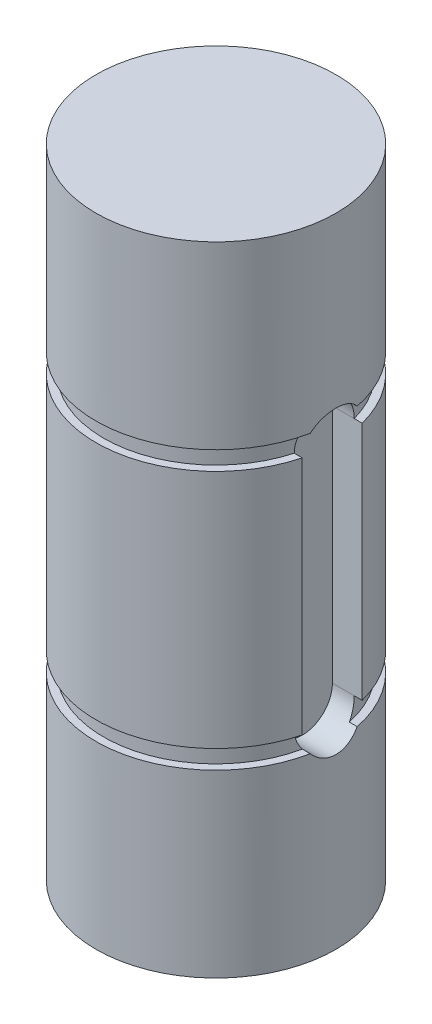
ISO-10303-21;
HEADER;
FILE_DESCRIPTION(('STEP AP214'),'2;1');
FILE_NAME('part.step','',(''),(''),'','','');
FILE_SCHEMA(('AUTOMOTIVE_DESIGN { 1 0 10303 214 1 1 1 1 }'));
ENDSEC;
DATA;
#1=APPLICATION_CONTEXT('core data for automotive mechanical design processes');
#2=APPLICATION_PROTOCOL_DEFINITION('international standard','automotive_design',2000,#1);
#3=PRODUCT_CONTEXT('',#1,'mechanical');
#4=PRODUCT('Part','Part','',(#3));
#5=PRODUCT_RELATED_PRODUCT_CATEGORY('part','',(#4));
#6=PRODUCT_DEFINITION_FORMATION('','',#4);
#7=PRODUCT_DEFINITION_CONTEXT('part definition',#1,'design');
#8=PRODUCT_DEFINITION('design','',#6,#7);
#9=PRODUCT_DEFINITION_SHAPE('','',#8);
#10=(LENGTH_UNIT() NAMED_UNIT(*) SI_UNIT(.MILLI.,.METRE.));
#11=(NAMED_UNIT(*) PLANE_ANGLE_UNIT() SI_UNIT($,.RADIAN.));
#12=(NAMED_UNIT(*) SI_UNIT($,.STERADIAN.) SOLID_ANGLE_UNIT());
#13=UNCERTAINTY_MEASURE_WITH_UNIT(LENGTH_MEASURE(1.E-05),#10,'distance_accuracy_value','');
#14=(GEOMETRIC_REPRESENTATION_CONTEXT(3) GLOBAL_UNCERTAINTY_ASSIGNED_CONTEXT((#13)) GLOBAL_UNIT_ASSIGNED_CONTEXT((#10,
#11,#12)) REPRESENTATION_CONTEXT('',''));
#15=CARTESIAN_POINT('',(0.,0.,0.));
#16=DIRECTION('',(0.,0.,1.));
#17=DIRECTION('',(1.,0.,0.));
#18=AXIS2_PLACEMENT_3D('',#15,#16,#17);
#19=CARTESIAN_POINT('',(0.,33.7312,0.));
#20=DIRECTION('',(0.,-1.,0.));
#21=DIRECTION('',(0.,0.,-1.));
#22=AXIS2_PLACEMENT_3D('',#19,#20,#21);
#23=CYLINDRICAL_SURFACE('',#22,6.35);
#24=DIRECTION('',(0.,-1.,0.));
#25=VECTOR('',#24,1.);
#26=CARTESIAN_POINT('',(6.14836106210428,33.7312,-1.5875));
#27=LINE('',#26,#25);
#28=CARTESIAN_POINT('',(6.14836106210427,10.5156,-1.5875));
#29=VERTEX_POINT('',#28);
#30=CARTESIAN_POINT('',(6.14836106210428,23.2156,-1.5875));
#31=VERTEX_POINT('',#30);
#32=EDGE_CURVE('E272',#29,#31,#27,.F.);
#33=ORIENTED_EDGE('',*,*,#32,.F.);
#34=CARTESIAN_POINT('',(0.,10.5156,0.));
#35=DIRECTION('',(0.,1.,0.));
#36=DIRECTION('',(0.,0.,1.));
#37=AXIS2_PLACEMENT_3D('',#34,#35,#36);
#38=CIRCLE('',#37,6.35);
#39=CARTESIAN_POINT('',(6.14836106210428,10.5156,1.5875));
#40=VERTEX_POINT('',#39);
#41=EDGE_CURVE('E189',#29,#40,#38,.T.);
#42=ORIENTED_EDGE('',*,*,#41,.T.);
#43=DIRECTION('',(0.,-1.,0.));
#44=VECTOR('',#43,1.);
#45=CARTESIAN_POINT('',(6.14836106210427,33.7312,1.5875));
#46=LINE('',#45,#44);
#47=CARTESIAN_POINT('',(6.14836106210428,23.2156,1.5875));
#48=VERTEX_POINT('',#47);
#49=EDGE_CURVE('E275',#40,#48,#46,.F.);
#50=ORIENTED_EDGE('',*,*,#49,.T.);
#51=CARTESIAN_POINT('',(0.,23.2156,0.));
#52=DIRECTION('',(0.,-1.,0.));
#53=DIRECTION('',(0.,0.,-1.));
#54=AXIS2_PLACEMENT_3D('',#51,#52,#53);
#55=CIRCLE('',#54,6.35);
#56=EDGE_CURVE('E193',#48,#31,#55,.T.);
#57=ORIENTED_EDGE('',*,*,#56,.T.);
#58=EDGE_LOOP('',(#33,#42,#50,#57));
#59=FACE_BOUND('',#58,.T.);
#60=ADVANCED_FACE('F32',(#59),#23,.T.);
#61=CARTESIAN_POINT('',(0.,23.2156,26.6920467660534));
#62=DIRECTION('',(0.,-1.,0.));
#63=DIRECTION('',(0.,0.,-1.));
#64=AXIS2_PLACEMENT_3D('',#61,#62,#63);
#65=PLANE('',#64);
#66=DIRECTION('',(1.,0.,0.));
#67=VECTOR('',#66,1.);
#68=CARTESIAN_POINT('',(4.572,23.2156,-1.5875));
#69=LINE('',#68,#67);
#70=CARTESIAN_POINT('',(5.72767184028554,23.2156,-1.5875));
#71=VERTEX_POINT('',#70);
#72=EDGE_CURVE('E144',#71,#31,#69,.T.);
#73=ORIENTED_EDGE('',*,*,#72,.T.);
#74=ORIENTED_EDGE('',*,*,#56,.F.);
#75=DIRECTION('',(1.,0.,0.));
#76=VECTOR('',#75,1.);
#77=CARTESIAN_POINT('',(4.572,23.2156,1.5875));
#78=LINE('',#77,#76);
#79=CARTESIAN_POINT('',(5.72767184028554,23.2156,1.5875));
#80=VERTEX_POINT('',#79);
#81=EDGE_CURVE('E123',#80,#48,#78,.T.);
#82=ORIENTED_EDGE('',*,*,#81,.F.);
#83=CARTESIAN_POINT('',(0.,23.2156,0.));
#84=DIRECTION('',(0.,1.,0.));
#85=DIRECTION('',(0.,0.,1.));
#86=AXIS2_PLACEMENT_3D('',#83,#84,#85);
#87=CIRCLE('',#86,5.9436);
#88=EDGE_CURVE('E200',#71,#80,#87,.T.);
#89=ORIENTED_EDGE('',*,*,#88,.F.);
#90=EDGE_LOOP('',(#73,#74,#82,#89));
#91=FACE_BOUND('',#90,.T.);
#92=ADVANCED_FACE('F246',(#91),#65,.F.);
#93=CARTESIAN_POINT('',(0.,24.2062,26.6920467660534));
#94=DIRECTION('',(0.,1.,0.));
#95=DIRECTION('',(0.,0.,1.));
#96=AXIS2_PLACEMENT_3D('',#93,#94,#95);
#97=PLANE('',#96);
#98=CARTESIAN_POINT('',(0.,24.2062,0.));
#99=DIRECTION('',(0.,1.,0.));
#100=DIRECTION('',(0.,0.,1.));
#101=AXIS2_PLACEMENT_3D('',#98,#99,#100);
#102=CIRCLE('',#101,5.9436);
#103=CARTESIAN_POINT('',(5.81270273366874,24.2062,-1.24051114061906));
#104=VERTEX_POINT('',#103);
#105=CARTESIAN_POINT('',(5.81270273366874,24.2062,1.24051114061906));
#106=VERTEX_POINT('',#105);
#107=EDGE_CURVE('E188',#104,#106,#102,.T.);
#108=ORIENTED_EDGE('',*,*,#107,.T.);
#109=DIRECTION('',(1.,0.,0.));
#110=VECTOR('',#109,1.);
#111=CARTESIAN_POINT('',(4.572,24.2062,1.24051114061906));
#112=LINE('',#111,#110);
#113=CARTESIAN_POINT('',(6.22765060917839,24.2062,1.24051114061906));
#114=VERTEX_POINT('',#113);
#115=EDGE_CURVE('E60',#106,#114,#112,.T.);
#116=ORIENTED_EDGE('',*,*,#115,.T.);
#117=CARTESIAN_POINT('',(0.,24.2062,0.));
#118=DIRECTION('',(0.,1.,0.));
#119=DIRECTION('',(0.,0.,1.));
#120=AXIS2_PLACEMENT_3D('',#117,#118,#119);
#121=CIRCLE('',#120,6.35);
#122=CARTESIAN_POINT('',(6.22765060917839,24.2062,-1.24051114061906));
#123=VERTEX_POINT('',#122);
#124=EDGE_CURVE('E197',#123,#114,#121,.T.);
#125=ORIENTED_EDGE('',*,*,#124,.F.);
#126=DIRECTION('',(1.,0.,0.));
#127=VECTOR('',#126,1.);
#128=CARTESIAN_POINT('',(4.572,24.2062,-1.24051114061906));
#129=LINE('',#128,#127);
#130=EDGE_CURVE('E269',#123,#104,#129,.F.);
#131=ORIENTED_EDGE('',*,*,#130,.T.);
#132=EDGE_LOOP('',(#108,#116,#125,#131));
#133=FACE_BOUND('',#132,.T.);
#134=ADVANCED_FACE('F251',(#133),#97,.F.);
#135=CARTESIAN_POINT('',(0.,25.5170502343723,0.));
#136=DIRECTION('',(0.,1.,0.));
#137=DIRECTION('',(0.,0.,1.));
#138=AXIS2_PLACEMENT_3D('',#135,#136,#137);
#139=CYLINDRICAL_SURFACE('',#138,5.9436);
#140=ORIENTED_EDGE('',*,*,#88,.T.);
#141=CARTESIAN_POINT('',(5.72767184028554,23.2156,1.5875));
#142=CARTESIAN_POINT('',(5.72766804610027,23.2599788866215,1.58750194805808));
#143=CARTESIAN_POINT('',(5.72818813422053,23.3043382686311,1.58563830137082));
#144=CARTESIAN_POINT('',(5.73024000478096,23.392712391909,1.57821195212509));
#145=CARTESIAN_POINT('',(5.73177154850906,23.4367272120173,1.57265012236694));
#146=CARTESIAN_POINT('',(5.73771384551916,23.5653217209515,1.55088835422927));
#147=CARTESIAN_POINT('',(5.74347777277273,23.6490289517323,1.52960258418085));
#148=CARTESIAN_POINT('',(5.75836292111803,23.8153481785975,1.47259415694831));
#149=CARTESIAN_POINT('',(5.76762462415825,23.8977380974612,1.43626019797556));
#150=CARTESIAN_POINT('',(5.78329806159334,24.0168087718749,1.37126100174845));
#151=CARTESIAN_POINT('',(5.78891663315768,24.0562960658287,1.34740876355262));
#152=CARTESIAN_POINT('',(5.80055334186276,24.1330038913665,1.29639711833931));
#153=CARTESIAN_POINT('',(5.80657142646175,24.1702247197941,1.26923814581491));
#154=CARTESIAN_POINT('',(5.81270273366874,24.2062,1.24051114061906));
#155=B_SPLINE_CURVE_WITH_KNOTS('',3,(#141,#142,#143,#144,#145,#146,#147,#148,#149,#150,#151,
#152,#153,#154),.UNSPECIFIED.,.F.,.F.,(4,2,2,2,2,2,4),(0.,0.13305635000979,0.26608130881389,
0.524501760701662,0.794649138064699,0.933915485774885,1.07316355409293),.UNSPECIFIED.);
#156=EDGE_CURVE('E119',#80,#106,#155,.T.);
#157=ORIENTED_EDGE('',*,*,#156,.T.);
#158=ORIENTED_EDGE('',*,*,#107,.F.);
#159=CARTESIAN_POINT('',(5.81270273366874,24.2062,-1.24051114061906));
#160=CARTESIAN_POINT('',(5.80676093223229,24.17133733761,-1.26835031027519));
#161=CARTESIAN_POINT('',(5.8009253407225,24.1353032972455,-1.29471734166642));
#162=CARTESIAN_POINT('',(5.78962448943312,24.061101088542,-1.34435038702208));
#163=CARTESIAN_POINT('',(5.78415925642407,24.0229327662943,-1.36761617693749));
#164=CARTESIAN_POINT('',(5.76886044428707,23.9078281402528,-1.43125963250244));
#165=CARTESIAN_POINT('',(5.75975979338477,23.828231861975,-1.46711930717738));
#166=CARTESIAN_POINT('',(5.74448324543572,23.6625483974185,-1.52585859113951));
#167=CARTESIAN_POINT('',(5.73835992335597,23.576373607262,-1.54850619216327));
#168=CARTESIAN_POINT('',(5.73203917642506,23.4438296974734,-1.57167662157916));
#169=CARTESIAN_POINT('',(5.73040804690452,23.3984147554939,-1.57760264372825));
#170=CARTESIAN_POINT('',(5.72822216727329,23.3072074368185,-1.58551566901053));
#171=CARTESIAN_POINT('',(5.72766765395878,23.2614149793135,-1.58750180558824));
#172=CARTESIAN_POINT('',(5.72767184028554,23.2156,-1.5875));
#173=B_SPLINE_CURVE_WITH_KNOTS('',3,(#159,#160,#161,#162,#163,#164,#165,#166,#167,#168,#169,
#170,#171,#172),.UNSPECIFIED.,.F.,.F.,(4,2,2,2,2,2,4),(0.,0.13494965007682,0.26990904430556,
0.531960547427977,0.798485077464082,0.935809383428476,1.07316388974743),.UNSPECIFIED.);
#174=EDGE_CURVE('E219',#104,#71,#173,.T.);
#175=ORIENTED_EDGE('',*,*,#174,.T.);
#176=EDGE_LOOP('',(#140,#157,#158,#175));
#177=FACE_BOUND('',#176,.T.);
#178=ADVANCED_FACE('F224',(#177),#139,.T.);
#179=CARTESIAN_POINT('',(0.,33.7312,0.));
#180=DIRECTION('',(0.,1.,0.));
#181=DIRECTION('',(0.,0.,1.));
#182=AXIS2_PLACEMENT_3D('',#179,#180,#181);
#183=PLANE('',#182);
#184=CARTESIAN_POINT('',(0.,33.7312,0.));
#185=DIRECTION('',(0.,1.,0.));
#186=DIRECTION('',(0.,0.,1.));
#187=AXIS2_PLACEMENT_3D('',#184,#185,#186);
#188=CIRCLE('',#187,6.35);
#189=CARTESIAN_POINT('',(0.,33.7312,6.35));
#190=VERTEX_POINT('',#189);
#191=EDGE_CURVE('E184',#190,#190,#188,.T.);
#192=ORIENTED_EDGE('',*,*,#191,.T.);
#193=EDGE_LOOP('',(#192));
#194=FACE_BOUND('',#193,.T.);
#195=ADVANCED_FACE('F257',(#194),#183,.T.);
#196=ORIENTED_EDGE('',*,*,#124,.T.);
#197=CARTESIAN_POINT('',(6.22765060917839,24.2062,1.24051114061906));
#198=CARTESIAN_POINT('',(6.23320783945382,24.2411378215592,1.2126102393573));
#199=CARTESIAN_POINT('',(6.23886039060933,24.2748712636352,1.18325559981259));
#200=CARTESIAN_POINT('',(6.25020149422038,24.339741606585,1.12181126216661));
#201=CARTESIAN_POINT('',(6.25589004691655,24.3708784900839,1.08972154576645));
#202=CARTESIAN_POINT('',(6.2727722846694,24.4600837099081,0.989640681923255));
#203=CARTESIAN_POINT('',(6.28378811857192,24.5139801382244,0.917811004237599));
#204=CARTESIAN_POINT('',(6.3041083179383,24.6090151207872,0.765894226562205));
#205=CARTESIAN_POINT('',(6.31341126157691,24.6501430955301,0.685800351954505));
#206=CARTESIAN_POINT('',(6.32925406928647,24.7183365380244,0.519609689028019));
#207=CARTESIAN_POINT('',(6.33579564411445,24.7454107149523,0.433516656017828));
#208=CARTESIAN_POINT('',(6.34529454604823,24.7842846308184,0.259270320083057));
#209=CARTESIAN_POINT('',(6.34830987825246,24.7963317849185,0.171175393891058));
#210=CARTESIAN_POINT('',(6.35061397512241,24.8055608892268,-0.00584854805475006));
#211=CARTESIAN_POINT('',(6.34990259861924,24.802742276315,-0.0947775952779503));
#212=CARTESIAN_POINT('',(6.34488868818956,24.7825583908652,-0.268922050286369));
#213=CARTESIAN_POINT('',(6.34066327595629,24.765505485485,-0.354176205390181));
#214=CARTESIAN_POINT('',(6.32917385599744,24.7178081997939,-0.520596366331586));
#215=CARTESIAN_POINT('',(6.32190904766935,24.6871602383026,-0.601761288714865));
#216=CARTESIAN_POINT('',(6.30501409455028,24.6128048506769,-0.758684558613027));
#217=CARTESIAN_POINT('',(6.29535881787929,24.5689575225197,-0.834373638215747));
#218=CARTESIAN_POINT('',(6.27474734999085,24.4695771479035,-0.977374398357579));
#219=CARTESIAN_POINT('',(6.26379263841329,24.41405733804,-1.04469543181985));
#220=CARTESIAN_POINT('',(6.24855866645397,24.3303466372952,-1.13075323727132));
#221=CARTESIAN_POINT('',(6.24433654135724,24.3064629829803,-1.15381013700283));
#222=CARTESIAN_POINT('',(6.23594250238016,24.2573387160929,-1.19834525875782));
#223=CARTESIAN_POINT('',(6.2317705110774,24.2321006532646,-1.21982627860311));
#224=CARTESIAN_POINT('',(6.22765060917839,24.2062,-1.24051114061906));
#225=B_SPLINE_CURVE_WITH_KNOTS('',3,(#197,#198,#199,#200,#201,#202,#203,#204,#205,#206,#207,
#208,#209,#210,#211,#212,#213,#214,#215,#216,#217,#218,#219,#220,#221,#222,#223,#224),
.UNSPECIFIED.,.F.,.F.,(4,2,2,2,2,2,2,2,2,2,2,2,2,4),(0.,0.135083283921325,0.270167471681556,
0.540207610771848,0.810470902383522,1.08056651055368,1.34615372554165,1.6117510011295,
1.87166851811822,2.13165454271636,2.39449949657434,2.65704797661509,2.75739135215893,
2.8575520354902),.UNSPECIFIED.);
#226=EDGE_CURVE('E11',#114,#123,#225,.T.);
#227=ORIENTED_EDGE('',*,*,#226,.T.);
#228=EDGE_LOOP('',(#196,#227));
#229=FACE_BOUND('',#228,.T.);
#230=ORIENTED_EDGE('',*,*,#191,.F.);
#231=EDGE_LOOP('',(#230));
#232=FACE_BOUND('',#231,.T.);
#233=ADVANCED_FACE('F34',(#229,#232),#23,.T.);
#234=CARTESIAN_POINT('',(0.,9.525,21.2804229426845));
#235=DIRECTION('',(0.,-1.,0.));
#236=DIRECTION('',(0.,0.,-1.));
#237=AXIS2_PLACEMENT_3D('',#234,#235,#236);
#238=PLANE('',#237);
#239=CARTESIAN_POINT('',(0.,9.525,0.));
#240=DIRECTION('',(0.,1.,0.));
#241=DIRECTION('',(0.,0.,1.));
#242=AXIS2_PLACEMENT_3D('',#239,#240,#241);
#243=CIRCLE('',#242,5.9436);
#244=CARTESIAN_POINT('',(5.81270273366873,9.525,-1.24051114061906));
#245=VERTEX_POINT('',#244);
#246=CARTESIAN_POINT('',(5.81270273366873,9.525,1.24051114061906));
#247=VERTEX_POINT('',#246);
#248=EDGE_CURVE('E192',#245,#247,#243,.T.);
#249=ORIENTED_EDGE('',*,*,#248,.F.);
#250=DIRECTION('',(1.,0.,0.));
#251=VECTOR('',#250,1.);
#252=CARTESIAN_POINT('',(4.572,9.525,-1.24051114061906));
#253=LINE('',#252,#251);
#254=CARTESIAN_POINT('',(6.22765060917839,9.52500000000001,-1.24051114061906));
#255=VERTEX_POINT('',#254);
#256=EDGE_CURVE('E151',#245,#255,#253,.T.);
#257=ORIENTED_EDGE('',*,*,#256,.T.);
#258=CARTESIAN_POINT('',(0.,9.52500000000001,0.));
#259=DIRECTION('',(0.,-1.,0.));
#260=DIRECTION('',(0.,0.,-1.));
#261=AXIS2_PLACEMENT_3D('',#258,#259,#260);
#262=CIRCLE('',#261,6.35);
#263=CARTESIAN_POINT('',(6.22765060917839,9.52500000000001,1.24051114061906));
#264=VERTEX_POINT('',#263);
#265=EDGE_CURVE('E185',#264,#255,#262,.T.);
#266=ORIENTED_EDGE('',*,*,#265,.F.);
#267=DIRECTION('',(1.,0.,0.));
#268=VECTOR('',#267,1.);
#269=CARTESIAN_POINT('',(4.572,9.525,1.24051114061906));
#270=LINE('',#269,#268);
#271=EDGE_CURVE('E52',#264,#247,#270,.F.);
#272=ORIENTED_EDGE('',*,*,#271,.T.);
#273=EDGE_LOOP('',(#249,#257,#266,#272));
#274=FACE_BOUND('',#273,.T.);
#275=ADVANCED_FACE('F235',(#274),#238,.F.);
#276=CARTESIAN_POINT('',(0.,10.5156,21.2804229426845));
#277=DIRECTION('',(0.,1.,0.));
#278=DIRECTION('',(0.,0.,1.));
#279=AXIS2_PLACEMENT_3D('',#276,#277,#278);
#280=PLANE('',#279);
#281=ORIENTED_EDGE('',*,*,#41,.F.);
#282=DIRECTION('',(1.,0.,0.));
#283=VECTOR('',#282,1.);
#284=CARTESIAN_POINT('',(4.572,10.5156,-1.5875));
#285=LINE('',#284,#283);
#286=CARTESIAN_POINT('',(5.72767184028554,10.5156,-1.5875));
#287=VERTEX_POINT('',#286);
#288=EDGE_CURVE('E148',#287,#29,#285,.T.);
#289=ORIENTED_EDGE('',*,*,#288,.F.);
#290=CARTESIAN_POINT('',(0.,10.5156,0.));
#291=DIRECTION('',(0.,1.,0.));
#292=DIRECTION('',(0.,0.,1.));
#293=AXIS2_PLACEMENT_3D('',#290,#291,#292);
#294=CIRCLE('',#293,5.9436);
#295=CARTESIAN_POINT('',(5.72767184028554,10.5156,1.5875));
#296=VERTEX_POINT('',#295);
#297=EDGE_CURVE('E211',#287,#296,#294,.T.);
#298=ORIENTED_EDGE('',*,*,#297,.T.);
#299=DIRECTION('',(1.,0.,0.));
#300=VECTOR('',#299,1.);
#301=CARTESIAN_POINT('',(4.572,10.5156,1.5875));
#302=LINE('',#301,#300);
#303=EDGE_CURVE('E122',#296,#40,#302,.T.);
#304=ORIENTED_EDGE('',*,*,#303,.T.);
#305=EDGE_LOOP('',(#281,#289,#298,#304));
#306=FACE_BOUND('',#305,.T.);
#307=ADVANCED_FACE('F231',(#306),#280,.F.);
#308=CARTESIAN_POINT('',(0.,15.810643297175,0.));
#309=DIRECTION('',(0.,1.,0.));
#310=DIRECTION('',(0.,0.,1.));
#311=AXIS2_PLACEMENT_3D('',#308,#309,#310);
#312=CYLINDRICAL_SURFACE('',#311,5.9436);
#313=ORIENTED_EDGE('',*,*,#248,.T.);
#314=CARTESIAN_POINT('',(5.81270273366874,9.525,1.24051114061906));
#315=CARTESIAN_POINT('',(5.80676093223229,9.55986266239004,1.26835031027519));
#316=CARTESIAN_POINT('',(5.8009253407225,9.59589670275452,1.29471734166642));
#317=CARTESIAN_POINT('',(5.78962448943312,9.67009891145804,1.34435038702208));
#318=CARTESIAN_POINT('',(5.78415925642407,9.7082672337057,1.3676161769375));
#319=CARTESIAN_POINT('',(5.76886044428707,9.82337185974724,1.43125963250244));
#320=CARTESIAN_POINT('',(5.75975979338477,9.90296813802501,1.46711930717738));
#321=CARTESIAN_POINT('',(5.74448324543573,10.0686516025815,1.52585859113951));
#322=CARTESIAN_POINT('',(5.73835992335597,10.154826392738,1.54850619216327));
#323=CARTESIAN_POINT('',(5.73203917642506,10.2873703025266,1.57167662157916));
#324=CARTESIAN_POINT('',(5.73040804690452,10.3327852445061,1.57760264372825));
#325=CARTESIAN_POINT('',(5.72822216727329,10.4239925631815,1.58551566901053));
#326=CARTESIAN_POINT('',(5.72766765395878,10.4697850206865,1.58750180558824));
#327=CARTESIAN_POINT('',(5.72767184028554,10.5156,1.5875));
#328=B_SPLINE_CURVE_WITH_KNOTS('',3,(#314,#315,#316,#317,#318,#319,#320,#321,#322,#323,#324,
#325,#326,#327),.UNSPECIFIED.,.F.,.F.,(4,2,2,2,2,2,4),(0.,0.134949650076818,0.269909044305558,
0.531960547427973,0.798485077464077,0.935809383428472,1.07316388974743),.UNSPECIFIED.);
#329=EDGE_CURVE('E162',#247,#296,#328,.T.);
#330=ORIENTED_EDGE('',*,*,#329,.T.);
#331=ORIENTED_EDGE('',*,*,#297,.F.);
#332=CARTESIAN_POINT('',(5.72767184028554,10.5156,-1.5875));
#333=CARTESIAN_POINT('',(5.72766804610027,10.4712211133786,-1.58750194805808));
#334=CARTESIAN_POINT('',(5.72818813422053,10.4268617313689,-1.58563830137082));
#335=CARTESIAN_POINT('',(5.73024000478097,10.338487608091,-1.57821195212509));
#336=CARTESIAN_POINT('',(5.73177154850907,10.2944727879828,-1.57265012236694));
#337=CARTESIAN_POINT('',(5.73771384551916,10.1658782790485,-1.55088835422927));
#338=CARTESIAN_POINT('',(5.74347777277273,10.0821710482677,-1.52960258418085));
#339=CARTESIAN_POINT('',(5.75836292111803,9.91585182140255,-1.47259415694831));
#340=CARTESIAN_POINT('',(5.76762462415825,9.83346190253884,-1.43626019797556));
#341=CARTESIAN_POINT('',(5.78329806159334,9.71439122812507,-1.37126100174845));
#342=CARTESIAN_POINT('',(5.78891663315768,9.67490393417133,-1.34740876355262));
#343=CARTESIAN_POINT('',(5.80055334186276,9.59819610863347,-1.29639711833932));
#344=CARTESIAN_POINT('',(5.80657142646175,9.56097528020593,-1.26923814581492));
#345=CARTESIAN_POINT('',(5.81270273366874,9.52500000000001,-1.24051114061906));
#346=B_SPLINE_CURVE_WITH_KNOTS('',3,(#332,#333,#334,#335,#336,#337,#338,#339,#340,#341,#342,
#343,#344,#345),.UNSPECIFIED.,.F.,.F.,(4,2,2,2,2,2,4),(0.,0.133056350009787,0.266081308813888,
0.524501760701664,0.794649138064696,0.933915485774881,1.07316355409293),.UNSPECIFIED.);
#347=EDGE_CURVE('E154',#287,#245,#346,.T.);
#348=ORIENTED_EDGE('',*,*,#347,.T.);
#349=EDGE_LOOP('',(#313,#330,#331,#348));
#350=FACE_BOUND('',#349,.T.);
#351=ADVANCED_FACE('F167',(#350),#312,.T.);
#352=CARTESIAN_POINT('',(0.,0.,0.));
#353=DIRECTION('',(0.,1.,0.));
#354=DIRECTION('',(0.,0.,1.));
#355=AXIS2_PLACEMENT_3D('',#352,#353,#354);
#356=PLANE('',#355);
#357=CARTESIAN_POINT('',(0.,0.,0.));
#358=DIRECTION('',(0.,1.,0.));
#359=DIRECTION('',(0.,0.,1.));
#360=AXIS2_PLACEMENT_3D('',#357,#358,#359);
#361=CIRCLE('',#360,6.35);
#362=CARTESIAN_POINT('',(0.,0.,6.35));
#363=VERTEX_POINT('',#362);
#364=EDGE_CURVE('E196',#363,#363,#361,.T.);
#365=ORIENTED_EDGE('',*,*,#364,.F.);
#366=EDGE_LOOP('',(#365));
#367=FACE_BOUND('',#366,.T.);
#368=ADVANCED_FACE('F241',(#367),#356,.F.);
#369=ORIENTED_EDGE('',*,*,#265,.T.);
#370=CARTESIAN_POINT('',(6.22765060917839,9.52500000000001,-1.24051114061906));
#371=CARTESIAN_POINT('',(6.23320783945382,9.49006217844083,-1.2126102393573));
#372=CARTESIAN_POINT('',(6.23886039060933,9.45632873636476,-1.18325559981259));
#373=CARTESIAN_POINT('',(6.25020149422038,9.39145839341497,-1.12181126216662));
#374=CARTESIAN_POINT('',(6.25589004691655,9.36032150991614,-1.08972154576646));
#375=CARTESIAN_POINT('',(6.2727722846694,9.27111629009191,-0.989640681923262));
#376=CARTESIAN_POINT('',(6.28378811857192,9.21721986177557,-0.917811004237607));
#377=CARTESIAN_POINT('',(6.3041083179383,9.12218487921284,-0.765894226562215));
#378=CARTESIAN_POINT('',(6.31341126157691,9.08105690446996,-0.685800351954514));
#379=CARTESIAN_POINT('',(6.32925406928647,9.01286346197562,-0.519609689028029));
#380=CARTESIAN_POINT('',(6.33579564411445,8.98578928504775,-0.433516656017839));
#381=CARTESIAN_POINT('',(6.34529454604823,8.9469153691816,-0.25927032008307));
#382=CARTESIAN_POINT('',(6.34830987825245,8.9348682150815,-0.17117539389107));
#383=CARTESIAN_POINT('',(6.35061397512241,8.92563911077321,0.0058485480547368));
#384=CARTESIAN_POINT('',(6.34990259861924,8.92845772368498,0.0947775952779368));
#385=CARTESIAN_POINT('',(6.34488868818956,8.94864160913476,0.268922050286356));
#386=CARTESIAN_POINT('',(6.34066327595629,8.96569451451501,0.354176205390168));
#387=CARTESIAN_POINT('',(6.32917385599744,9.01339180020609,0.520596366331574));
#388=CARTESIAN_POINT('',(6.32190904766935,9.04403976169738,0.601761288714853));
#389=CARTESIAN_POINT('',(6.30501409455029,9.11839514932309,0.758684558613016));
#390=CARTESIAN_POINT('',(6.2953588178793,9.16224247748032,0.834373638215736));
#391=CARTESIAN_POINT('',(6.27474734999086,9.26162285209645,0.977374398357569));
#392=CARTESIAN_POINT('',(6.26379263841329,9.31714266196002,1.04469543181984));
#393=CARTESIAN_POINT('',(6.24855866645397,9.4008533627048,1.13075323727132));
#394=CARTESIAN_POINT('',(6.24433654135724,9.42473701701972,1.15381013700283));
#395=CARTESIAN_POINT('',(6.23594250238016,9.47386128390711,1.19834525875783));
#396=CARTESIAN_POINT('',(6.2317705110774,9.49909934673536,1.21982627860311));
#397=CARTESIAN_POINT('',(6.22765060917839,9.52500000000001,1.24051114061906));
#398=B_SPLINE_CURVE_WITH_KNOTS('',3,(#370,#371,#372,#373,#374,#375,#376,#377,#378,#379,#380,
#381,#382,#383,#384,#385,#386,#387,#388,#389,#390,#391,#392,#393,#394,#395,#396,#397),
.UNSPECIFIED.,.F.,.F.,(4,2,2,2,2,2,2,2,2,2,2,2,2,4),(0.,0.135083283921324,0.270167471681553,
0.540207610771844,0.810470902383518,1.08056651055367,1.34615372554164,1.61175100112949,
1.87166851811821,2.13165454271635,2.39449949657434,2.65704797661509,2.75739135215894,
2.85755203549021),.UNSPECIFIED.);
#399=EDGE_CURVE('E45',#255,#264,#398,.T.);
#400=ORIENTED_EDGE('',*,*,#399,.T.);
#401=EDGE_LOOP('',(#369,#400));
#402=FACE_BOUND('',#401,.T.);
#403=ORIENTED_EDGE('',*,*,#364,.T.);
#404=EDGE_LOOP('',(#403));
#405=FACE_BOUND('',#404,.T.);
#406=ADVANCED_FACE('F230',(#402,#405),#23,.T.);
#407=CARTESIAN_POINT('',(4.572,23.2156,0.));
#408=DIRECTION('',(1.,0.,0.));
#409=DIRECTION('',(0.,0.,-1.));
#410=AXIS2_PLACEMENT_3D('',#407,#408,#409);
#411=CYLINDRICAL_SURFACE('',#410,1.5875);
#412=CARTESIAN_POINT('',(4.572,23.2156,1.5875));
#413=VERTEX_POINT('',#412);
#414=EDGE_CURVE('E113',#413,#80,#78,.T.);
#415=ORIENTED_EDGE('',*,*,#414,.F.);
#416=CARTESIAN_POINT('',(4.572,23.2156,0.));
#417=DIRECTION('',(1.,0.,0.));
#418=DIRECTION('',(0.,0.,-1.));
#419=AXIS2_PLACEMENT_3D('',#416,#417,#418);
#420=CIRCLE('',#419,1.5875);
#421=CARTESIAN_POINT('',(4.572,23.2156,-1.5875));
#422=VERTEX_POINT('',#421);
#423=EDGE_CURVE('E118',#422,#413,#420,.T.);
#424=ORIENTED_EDGE('',*,*,#423,.F.);
#425=EDGE_CURVE('E142',#422,#71,#69,.T.);
#426=ORIENTED_EDGE('',*,*,#425,.T.);
#427=ORIENTED_EDGE('',*,*,#174,.F.);
#428=ORIENTED_EDGE('',*,*,#130,.F.);
#429=ORIENTED_EDGE('',*,*,#226,.F.);
#430=ORIENTED_EDGE('',*,*,#115,.F.);
#431=ORIENTED_EDGE('',*,*,#156,.F.);
#432=EDGE_LOOP('',(#415,#424,#426,#427,#428,#429,#430,#431));
#433=FACE_BOUND('',#432,.T.);
#434=ADVANCED_FACE('F115',(#433),#411,.F.);
#435=CARTESIAN_POINT('',(4.572,23.2156,-1.5875));
#436=DIRECTION('',(0.,0.,1.));
#437=DIRECTION('',(0.,-1.,0.));
#438=AXIS2_PLACEMENT_3D('',#435,#436,#437);
#439=PLANE('',#438);
#440=ORIENTED_EDGE('',*,*,#32,.T.);
#441=ORIENTED_EDGE('',*,*,#72,.F.);
#442=ORIENTED_EDGE('',*,*,#425,.F.);
#443=DIRECTION('',(0.,-1.,0.));
#444=VECTOR('',#443,1.);
#445=CARTESIAN_POINT('',(4.572,23.2156,-1.5875));
#446=LINE('',#445,#444);
#447=CARTESIAN_POINT('',(4.572,10.5156,-1.5875));
#448=VERTEX_POINT('',#447);
#449=EDGE_CURVE('E137',#422,#448,#446,.T.);
#450=ORIENTED_EDGE('',*,*,#449,.T.);
#451=EDGE_CURVE('E145',#448,#287,#285,.T.);
#452=ORIENTED_EDGE('',*,*,#451,.T.);
#453=ORIENTED_EDGE('',*,*,#288,.T.);
#454=EDGE_LOOP('',(#440,#441,#442,#450,#452,#453));
#455=FACE_BOUND('',#454,.T.);
#456=ADVANCED_FACE('F176',(#455),#439,.T.);
#457=CARTESIAN_POINT('',(4.572,23.2156,1.5875));
#458=DIRECTION('',(0.,0.,1.));
#459=DIRECTION('',(0.,-1.,0.));
#460=AXIS2_PLACEMENT_3D('',#457,#458,#459);
#461=PLANE('',#460);
#462=ORIENTED_EDGE('',*,*,#303,.F.);
#463=CARTESIAN_POINT('',(4.572,10.5156,1.5875));
#464=VERTEX_POINT('',#463);
#465=EDGE_CURVE('E129',#464,#296,#302,.T.);
#466=ORIENTED_EDGE('',*,*,#465,.F.);
#467=DIRECTION('',(0.,-1.,0.));
#468=VECTOR('',#467,1.);
#469=CARTESIAN_POINT('',(4.572,23.2156,1.5875));
#470=LINE('',#469,#468);
#471=EDGE_CURVE('E126',#413,#464,#470,.T.);
#472=ORIENTED_EDGE('',*,*,#471,.F.);
#473=ORIENTED_EDGE('',*,*,#414,.T.);
#474=ORIENTED_EDGE('',*,*,#81,.T.);
#475=ORIENTED_EDGE('',*,*,#49,.F.);
#476=EDGE_LOOP('',(#462,#466,#472,#473,#474,#475));
#477=FACE_BOUND('',#476,.T.);
#478=ADVANCED_FACE('F127',(#477),#461,.F.);
#479=CARTESIAN_POINT('',(4.572,10.5156,0.));
#480=DIRECTION('',(1.,0.,0.));
#481=DIRECTION('',(0.,0.,-1.));
#482=AXIS2_PLACEMENT_3D('',#479,#480,#481);
#483=CYLINDRICAL_SURFACE('',#482,1.5875);
#484=ORIENTED_EDGE('',*,*,#271,.F.);
#485=ORIENTED_EDGE('',*,*,#399,.F.);
#486=ORIENTED_EDGE('',*,*,#256,.F.);
#487=ORIENTED_EDGE('',*,*,#347,.F.);
#488=ORIENTED_EDGE('',*,*,#451,.F.);
#489=CARTESIAN_POINT('',(4.572,10.5156,0.));
#490=DIRECTION('',(1.,0.,0.));
#491=DIRECTION('',(0.,0.,-1.));
#492=AXIS2_PLACEMENT_3D('',#489,#490,#491);
#493=CIRCLE('',#492,1.5875);
#494=EDGE_CURVE('E133',#464,#448,#493,.T.);
#495=ORIENTED_EDGE('',*,*,#494,.F.);
#496=ORIENTED_EDGE('',*,*,#465,.T.);
#497=ORIENTED_EDGE('',*,*,#329,.F.);
#498=EDGE_LOOP('',(#484,#485,#486,#487,#488,#495,#496,#497));
#499=FACE_BOUND('',#498,.T.);
#500=ADVANCED_FACE('F171',(#499),#483,.F.);
#501=CARTESIAN_POINT('',(4.572,23.2156,0.));
#502=DIRECTION('',(1.,0.,0.));
#503=DIRECTION('',(0.,0.,-1.));
#504=AXIS2_PLACEMENT_3D('',#501,#502,#503);
#505=PLANE('',#504);
#506=ORIENTED_EDGE('',*,*,#423,.T.);
#507=ORIENTED_EDGE('',*,*,#471,.T.);
#508=ORIENTED_EDGE('',*,*,#494,.T.);
#509=ORIENTED_EDGE('',*,*,#449,.F.);
#510=EDGE_LOOP('',(#506,#507,#508,#509));
#511=FACE_BOUND('',#510,.T.);
#512=ADVANCED_FACE('F136',(#511),#505,.T.);
#513=CLOSED_SHELL('',(#60,#92,#134,#178,#195,#233,#275,#307,#351,#368,#406,#434,#456,#478,#500,#512));
#514=MANIFOLD_SOLID_BREP('B2',#513);
#515=ADVANCED_BREP_SHAPE_REPRESENTATION('',(#18,#514),#14);
#516=SHAPE_DEFINITION_REPRESENTATION(#9,#515);
ENDSEC;
END-ISO-10303-21;
